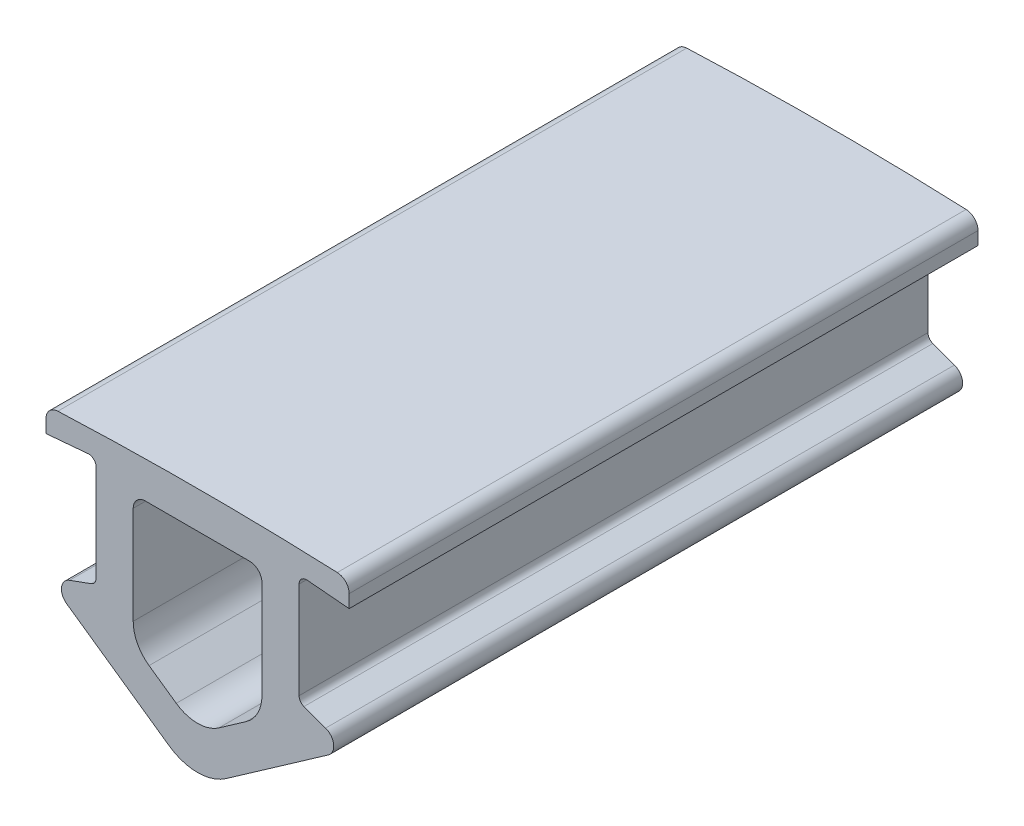
ISO-10303-21;
HEADER;
FILE_DESCRIPTION(('STEP AP214'),'2;1');
FILE_NAME('part.step','',(''),(''),'','','');
FILE_SCHEMA(('AUTOMOTIVE_DESIGN { 1 0 10303 214 1 1 1 1 }'));
ENDSEC;
DATA;
#1=APPLICATION_CONTEXT('core data for automotive mechanical design processes');
#2=APPLICATION_PROTOCOL_DEFINITION('international standard','automotive_design',2000,#1);
#3=PRODUCT_CONTEXT('',#1,'mechanical');
#4=PRODUCT('Part','Part','',(#3));
#5=PRODUCT_RELATED_PRODUCT_CATEGORY('part','',(#4));
#6=PRODUCT_DEFINITION_FORMATION('','',#4);
#7=PRODUCT_DEFINITION_CONTEXT('part definition',#1,'design');
#8=PRODUCT_DEFINITION('design','',#6,#7);
#9=PRODUCT_DEFINITION_SHAPE('','',#8);
#10=(LENGTH_UNIT() NAMED_UNIT(*) SI_UNIT(.MILLI.,.METRE.));
#11=(NAMED_UNIT(*) PLANE_ANGLE_UNIT() SI_UNIT($,.RADIAN.));
#12=(NAMED_UNIT(*) SI_UNIT($,.STERADIAN.) SOLID_ANGLE_UNIT());
#13=UNCERTAINTY_MEASURE_WITH_UNIT(LENGTH_MEASURE(1.E-05),#10,'distance_accuracy_value','');
#14=(GEOMETRIC_REPRESENTATION_CONTEXT(3) GLOBAL_UNCERTAINTY_ASSIGNED_CONTEXT((#13)) GLOBAL_UNIT_ASSIGNED_CONTEXT((#10,
#11,#12)) REPRESENTATION_CONTEXT('',''));
#15=CARTESIAN_POINT('',(0.,0.,0.));
#16=DIRECTION('',(0.,0.,1.));
#17=DIRECTION('',(1.,0.,0.));
#18=AXIS2_PLACEMENT_3D('',#15,#16,#17);
#19=CARTESIAN_POINT('',(4.9997820467107E-09,-133.869838655308,25.4));
#20=DIRECTION('',(0.,0.,-1.));
#21=DIRECTION('',(-1.,0.,0.));
#22=AXIS2_PLACEMENT_3D('',#19,#20,#21);
#23=CYLINDRICAL_SURFACE('',#22,135.012547725308);
#24=CARTESIAN_POINT('',(4.9997820467107E-09,-133.869838655308,0.));
#25=DIRECTION('',(0.,0.,1.));
#26=DIRECTION('',(1.,0.,0.));
#27=AXIS2_PLACEMENT_3D('',#24,#25,#26);
#28=CIRCLE('',#27,135.012547725308);
#29=CARTESIAN_POINT('',(5.64334073055143,1.02471552955858,0.));
#30=VERTEX_POINT('',#29);
#31=CARTESIAN_POINT('',(-5.64334072055146,1.0247155295586,0.));
#32=VERTEX_POINT('',#31);
#33=EDGE_CURVE('E296',#30,#32,#28,.T.);
#34=ORIENTED_EDGE('',*,*,#33,.T.);
#35=DIRECTION('',(0.,0.,-1.));
#36=VECTOR('',#35,1.);
#37=CARTESIAN_POINT('',(-5.64334072055146,1.0247155295586,25.4));
#38=LINE('',#37,#36);
#39=CARTESIAN_POINT('',(-5.64334072055146,1.0247155295586,25.4));
#40=VERTEX_POINT('',#39);
#41=EDGE_CURVE('E11',#40,#32,#38,.T.);
#42=ORIENTED_EDGE('',*,*,#41,.F.);
#43=CARTESIAN_POINT('',(4.9997820467107E-09,-133.869838655308,25.4));
#44=DIRECTION('',(0.,0.,1.));
#45=DIRECTION('',(1.,0.,0.));
#46=AXIS2_PLACEMENT_3D('',#43,#44,#45);
#47=CIRCLE('',#46,135.012547725308);
#48=CARTESIAN_POINT('',(5.64334073055143,1.02471552955858,25.4));
#49=VERTEX_POINT('',#48);
#50=EDGE_CURVE('E468',#49,#40,#47,.T.);
#51=ORIENTED_EDGE('',*,*,#50,.F.);
#52=DIRECTION('',(0.,0.,-1.));
#53=VECTOR('',#52,1.);
#54=CARTESIAN_POINT('',(5.64334073055143,1.02471552955858,25.4));
#55=LINE('',#54,#53);
#56=EDGE_CURVE('E343',#49,#30,#55,.T.);
#57=ORIENTED_EDGE('',*,*,#56,.T.);
#58=EDGE_LOOP('',(#34,#42,#51,#57));
#59=FACE_BOUND('',#58,.T.);
#60=ADVANCED_FACE('F35',(#59),#23,.T.);
#61=CARTESIAN_POINT('',(-5.62244140160035,0.525152513646621,25.4));
#62=DIRECTION('',(0.,0.,-1.));
#63=DIRECTION('',(-1.,0.,0.));
#64=AXIS2_PLACEMENT_3D('',#61,#62,#63);
#65=CYLINDRICAL_SURFACE('',#64,0.499999988399661);
#66=CARTESIAN_POINT('',(-5.62244140160035,0.525152513646621,0.));
#67=DIRECTION('',(0.,0.,1.));
#68=DIRECTION('',(1.,0.,0.));
#69=AXIS2_PLACEMENT_3D('',#66,#67,#68);
#70=CIRCLE('',#69,0.499999988399661);
#71=CARTESIAN_POINT('',(-6.12244139000001,0.525152513646621,0.));
#72=VERTEX_POINT('',#71);
#73=EDGE_CURVE('E299',#32,#72,#70,.T.);
#74=ORIENTED_EDGE('',*,*,#73,.T.);
#75=DIRECTION('',(0.,0.,-1.));
#76=VECTOR('',#75,1.);
#77=CARTESIAN_POINT('',(-6.12244139000001,0.525152513646621,25.4));
#78=LINE('',#77,#76);
#79=CARTESIAN_POINT('',(-6.12244139000001,0.525152513646621,25.4));
#80=VERTEX_POINT('',#79);
#81=EDGE_CURVE('E45',#80,#72,#78,.T.);
#82=ORIENTED_EDGE('',*,*,#81,.F.);
#83=CARTESIAN_POINT('',(-5.62244140160035,0.525152513646621,25.4));
#84=DIRECTION('',(0.,0.,1.));
#85=DIRECTION('',(1.,0.,0.));
#86=AXIS2_PLACEMENT_3D('',#83,#84,#85);
#87=CIRCLE('',#86,0.499999988399661);
#88=EDGE_CURVE('E470',#40,#80,#87,.T.);
#89=ORIENTED_EDGE('',*,*,#88,.F.);
#90=ORIENTED_EDGE('',*,*,#41,.T.);
#91=EDGE_LOOP('',(#74,#82,#89,#90));
#92=FACE_BOUND('',#91,.T.);
#93=ADVANCED_FACE('F524',(#92),#65,.T.);
#94=CARTESIAN_POINT('',(-6.12244139,0.,25.4));
#95=DIRECTION('',(1.,0.,0.));
#96=DIRECTION('',(0.,1.,0.));
#97=AXIS2_PLACEMENT_3D('',#94,#95,#96);
#98=PLANE('',#97);
#99=DIRECTION('',(0.,-1.,0.));
#100=VECTOR('',#99,1.);
#101=CARTESIAN_POINT('',(-6.12244139,0.,0.));
#102=LINE('',#101,#100);
#103=CARTESIAN_POINT('',(-6.12244139,0.,0.));
#104=VERTEX_POINT('',#103);
#105=EDGE_CURVE('E301',#72,#104,#102,.T.);
#106=ORIENTED_EDGE('',*,*,#105,.T.);
#107=DIRECTION('',(0.,0.,-1.));
#108=VECTOR('',#107,1.);
#109=CARTESIAN_POINT('',(-6.12244139,0.,25.4));
#110=LINE('',#109,#108);
#111=CARTESIAN_POINT('',(-6.12244139,0.,25.4));
#112=VERTEX_POINT('',#111);
#113=EDGE_CURVE('E379',#112,#104,#110,.T.);
#114=ORIENTED_EDGE('',*,*,#113,.F.);
#115=DIRECTION('',(0.,-1.,0.));
#116=VECTOR('',#115,1.);
#117=CARTESIAN_POINT('',(-6.12244139,0.,25.4));
#118=LINE('',#117,#116);
#119=EDGE_CURVE('E472',#80,#112,#118,.T.);
#120=ORIENTED_EDGE('',*,*,#119,.F.);
#121=ORIENTED_EDGE('',*,*,#81,.T.);
#122=EDGE_LOOP('',(#106,#114,#120,#121));
#123=FACE_BOUND('',#122,.T.);
#124=ADVANCED_FACE('F529',(#123),#98,.F.);
#125=CARTESIAN_POINT('',(-0.0465068209177292,0.531575395322367,25.4));
#126=DIRECTION('',(-0.0871557427805965,0.996194698088864,0.));
#127=DIRECTION('',(-0.996194698088864,-0.0871557427805965,0.));
#128=AXIS2_PLACEMENT_3D('',#125,#126,#127);
#129=PLANE('',#128);
#130=DIRECTION('',(0.996194698088864,0.0871557427805965,0.));
#131=VECTOR('',#130,1.);
#132=CARTESIAN_POINT('',(-0.0465068209177292,0.531575395322367,0.));
#133=LINE('',#132,#131);
#134=CARTESIAN_POINT('',(-4.42615282861294,0.148406019246547,0.));
#135=VERTEX_POINT('',#134);
#136=EDGE_CURVE('E303',#104,#135,#133,.T.);
#137=ORIENTED_EDGE('',*,*,#136,.T.);
#138=DIRECTION('',(0.,0.,-1.));
#139=VECTOR('',#138,1.);
#140=CARTESIAN_POINT('',(-4.42615282861294,0.148406019246547,25.4));
#141=LINE('',#140,#139);
#142=CARTESIAN_POINT('',(-4.42615282861294,0.148406019246547,25.4));
#143=VERTEX_POINT('',#142);
#144=EDGE_CURVE('E377',#143,#135,#141,.T.);
#145=ORIENTED_EDGE('',*,*,#144,.F.);
#146=DIRECTION('',(0.996194698088864,0.0871557427805965,0.));
#147=VECTOR('',#146,1.);
#148=CARTESIAN_POINT('',(-0.0465068209177292,0.531575395322367,25.4));
#149=LINE('',#148,#147);
#150=EDGE_CURVE('E474',#112,#143,#149,.T.);
#151=ORIENTED_EDGE('',*,*,#150,.F.);
#152=ORIENTED_EDGE('',*,*,#113,.T.);
#153=EDGE_LOOP('',(#137,#145,#151,#152));
#154=FACE_BOUND('',#153,.T.);
#155=ADVANCED_FACE('F608',(#154),#129,.F.);
#156=CARTESIAN_POINT('',(-4.40000610531548,-0.150452395475362,25.4));
#157=DIRECTION('',(0.,0.,-1.));
#158=DIRECTION('',(-1.,0.,0.));
#159=AXIS2_PLACEMENT_3D('',#156,#157,#158);
#160=CYLINDRICAL_SURFACE('',#159,0.300000005315477);
#161=CARTESIAN_POINT('',(-4.40000610531548,-0.150452395475362,0.));
#162=DIRECTION('',(0.,0.,1.));
#163=DIRECTION('',(1.,0.,0.));
#164=AXIS2_PLACEMENT_3D('',#161,#162,#163);
#165=CIRCLE('',#164,0.300000005315477);
#166=CARTESIAN_POINT('',(-4.1000061,-0.150452395475362,0.));
#167=VERTEX_POINT('',#166);
#168=EDGE_CURVE('E306',#167,#135,#165,.T.);
#169=ORIENTED_EDGE('',*,*,#168,.F.);
#170=DIRECTION('',(0.,0.,-1.));
#171=VECTOR('',#170,1.);
#172=CARTESIAN_POINT('',(-4.1000061,-0.150452395475362,25.4));
#173=LINE('',#172,#171);
#174=CARTESIAN_POINT('',(-4.1000061,-0.150452395475362,25.4));
#175=VERTEX_POINT('',#174);
#176=EDGE_CURVE('E375',#175,#167,#173,.T.);
#177=ORIENTED_EDGE('',*,*,#176,.F.);
#178=CARTESIAN_POINT('',(-4.40000610531548,-0.150452395475362,25.4));
#179=DIRECTION('',(0.,0.,1.));
#180=DIRECTION('',(1.,0.,0.));
#181=AXIS2_PLACEMENT_3D('',#178,#179,#180);
#182=CIRCLE('',#181,0.300000005315477);
#183=EDGE_CURVE('E476',#175,#143,#182,.T.);
#184=ORIENTED_EDGE('',*,*,#183,.T.);
#185=ORIENTED_EDGE('',*,*,#144,.T.);
#186=EDGE_LOOP('',(#169,#177,#184,#185));
#187=FACE_BOUND('',#186,.T.);
#188=ADVANCED_FACE('F604',(#187),#160,.F.);
#189=CARTESIAN_POINT('',(-4.1000061,0.,25.4));
#190=DIRECTION('',(1.,0.,0.));
#191=DIRECTION('',(0.,1.,0.));
#192=AXIS2_PLACEMENT_3D('',#189,#190,#191);
#193=PLANE('',#192);
#194=DIRECTION('',(0.,-1.,0.));
#195=VECTOR('',#194,1.);
#196=CARTESIAN_POINT('',(-4.1000061,0.,0.));
#197=LINE('',#196,#195);
#198=CARTESIAN_POINT('',(-4.1000061,-4.05582125151107,0.));
#199=VERTEX_POINT('',#198);
#200=EDGE_CURVE('E309',#167,#199,#197,.T.);
#201=ORIENTED_EDGE('',*,*,#200,.T.);
#202=DIRECTION('',(0.,0.,-1.));
#203=VECTOR('',#202,1.);
#204=CARTESIAN_POINT('',(-4.1000061,-4.05582125151107,25.4));
#205=LINE('',#204,#203);
#206=CARTESIAN_POINT('',(-4.1000061,-4.05582125151107,25.4));
#207=VERTEX_POINT('',#206);
#208=EDGE_CURVE('E373',#207,#199,#205,.T.);
#209=ORIENTED_EDGE('',*,*,#208,.F.);
#210=DIRECTION('',(0.,-1.,0.));
#211=VECTOR('',#210,1.);
#212=CARTESIAN_POINT('',(-4.1000061,0.,25.4));
#213=LINE('',#212,#211);
#214=EDGE_CURVE('E479',#175,#207,#213,.T.);
#215=ORIENTED_EDGE('',*,*,#214,.F.);
#216=ORIENTED_EDGE('',*,*,#176,.T.);
#217=EDGE_LOOP('',(#201,#209,#215,#216));
#218=FACE_BOUND('',#217,.T.);
#219=ADVANCED_FACE('F600',(#218),#193,.F.);
#220=CARTESIAN_POINT('',(-4.40000609869862,-4.05582125151107,25.4));
#221=DIRECTION('',(0.,0.,-1.));
#222=DIRECTION('',(-1.,0.,0.));
#223=AXIS2_PLACEMENT_3D('',#220,#221,#222);
#224=CYLINDRICAL_SURFACE('',#223,0.300000003697387);
#225=CARTESIAN_POINT('',(-4.40000609869862,-4.05582125151107,0.));
#226=DIRECTION('',(0.,0.,1.));
#227=DIRECTION('',(1.,0.,0.));
#228=AXIS2_PLACEMENT_3D('',#225,#226,#227);
#229=CIRCLE('',#228,0.300000003697387);
#230=CARTESIAN_POINT('',(-4.29740005128005,-4.33772904539204,0.));
#231=VERTEX_POINT('',#230);
#232=EDGE_CURVE('E312',#231,#199,#229,.T.);
#233=ORIENTED_EDGE('',*,*,#232,.F.);
#234=DIRECTION('',(0.,0.,-1.));
#235=VECTOR('',#234,1.);
#236=CARTESIAN_POINT('',(-4.29740005128005,-4.33772904539204,25.4));
#237=LINE('',#236,#235);
#238=CARTESIAN_POINT('',(-4.29740005128005,-4.33772904539204,25.4));
#239=VERTEX_POINT('',#238);
#240=EDGE_CURVE('E371',#239,#231,#237,.T.);
#241=ORIENTED_EDGE('',*,*,#240,.F.);
#242=CARTESIAN_POINT('',(-4.40000609869862,-4.05582125151107,25.4));
#243=DIRECTION('',(0.,0.,1.));
#244=DIRECTION('',(1.,0.,0.));
#245=AXIS2_PLACEMENT_3D('',#242,#243,#244);
#246=CIRCLE('',#245,0.300000003697387);
#247=EDGE_CURVE('E481',#239,#207,#246,.T.);
#248=ORIENTED_EDGE('',*,*,#247,.T.);
#249=ORIENTED_EDGE('',*,*,#208,.T.);
#250=EDGE_LOOP('',(#233,#241,#248,#249));
#251=FACE_BOUND('',#250,.T.);
#252=ADVANCED_FACE('F596',(#251),#224,.F.);
#253=CARTESIAN_POINT('',(0.891418934085434,-2.44915335356994,25.4));
#254=DIRECTION('',(0.342020148147696,-0.939692619030834,0.));
#255=DIRECTION('',(0.939692619030834,0.342020148147696,0.));
#256=AXIS2_PLACEMENT_3D('',#253,#254,#255);
#257=PLANE('',#256);
#258=DIRECTION('',(-0.939692619030834,-0.342020148147696,0.));
#259=VECTOR('',#258,1.);
#260=CARTESIAN_POINT('',(0.891418934085434,-2.44915335356994,0.));
#261=LINE('',#260,#259);
#262=CARTESIAN_POINT('',(-5.17101006481665,-4.65569709175305,0.));
#263=VERTEX_POINT('',#262);
#264=EDGE_CURVE('E315',#231,#263,#261,.T.);
#265=ORIENTED_EDGE('',*,*,#264,.T.);
#266=DIRECTION('',(0.,0.,-1.));
#267=VECTOR('',#266,1.);
#268=CARTESIAN_POINT('',(-5.17101006481665,-4.65569709175305,25.4));
#269=LINE('',#268,#267);
#270=CARTESIAN_POINT('',(-5.17101006481665,-4.65569709175305,25.4));
#271=VERTEX_POINT('',#270);
#272=EDGE_CURVE('E368',#271,#263,#269,.T.);
#273=ORIENTED_EDGE('',*,*,#272,.F.);
#274=DIRECTION('',(-0.939692619030834,-0.342020148147696,0.));
#275=VECTOR('',#274,1.);
#276=CARTESIAN_POINT('',(0.891418934085434,-2.44915335356994,25.4));
#277=LINE('',#276,#275);
#278=EDGE_CURVE('E484',#239,#271,#277,.T.);
#279=ORIENTED_EDGE('',*,*,#278,.F.);
#280=ORIENTED_EDGE('',*,*,#240,.T.);
#281=EDGE_LOOP('',(#265,#273,#279,#280));
#282=FACE_BOUND('',#281,.T.);
#283=ADVANCED_FACE('F592',(#282),#257,.F.);
#284=CARTESIAN_POINT('',(-4.9999999912156,-5.12554339996945,25.4));
#285=DIRECTION('',(0.,0.,-1.));
#286=DIRECTION('',(-1.,0.,0.));
#287=AXIS2_PLACEMENT_3D('',#284,#285,#286);
#288=CYLINDRICAL_SURFACE('',#287,0.499999998617614);
#289=CARTESIAN_POINT('',(-4.9999999912156,-5.12554339996945,0.));
#290=DIRECTION('',(0.,0.,1.));
#291=DIRECTION('',(1.,0.,0.));
#292=AXIS2_PLACEMENT_3D('',#289,#290,#291);
#293=CIRCLE('',#292,0.499999998617614);
#294=CARTESIAN_POINT('',(-5.28678820743577,-5.53511942179552,0.));
#295=VERTEX_POINT('',#294);
#296=EDGE_CURVE('E317',#263,#295,#293,.T.);
#297=ORIENTED_EDGE('',*,*,#296,.T.);
#298=DIRECTION('',(0.,0.,-1.));
#299=VECTOR('',#298,1.);
#300=CARTESIAN_POINT('',(-5.28678820743577,-5.53511942179552,25.4));
#301=LINE('',#300,#299);
#302=CARTESIAN_POINT('',(-5.28678820743577,-5.53511942179552,25.4));
#303=VERTEX_POINT('',#302);
#304=EDGE_CURVE('E365',#303,#295,#301,.T.);
#305=ORIENTED_EDGE('',*,*,#304,.F.);
#306=CARTESIAN_POINT('',(-4.9999999912156,-5.12554339996945,25.4));
#307=DIRECTION('',(0.,0.,1.));
#308=DIRECTION('',(1.,0.,0.));
#309=AXIS2_PLACEMENT_3D('',#306,#307,#308);
#310=CIRCLE('',#309,0.499999998617614);
#311=EDGE_CURVE('E486',#271,#303,#310,.T.);
#312=ORIENTED_EDGE('',*,*,#311,.F.);
#313=ORIENTED_EDGE('',*,*,#272,.T.);
#314=EDGE_LOOP('',(#297,#305,#312,#313));
#315=FACE_BOUND('',#314,.T.);
#316=ADVANCED_FACE('F588',(#315),#288,.T.);
#317=CARTESIAN_POINT('',(-4.33995549194015,-6.1980988226043,25.4));
#318=DIRECTION('',(0.573576434026151,0.819152045916901,0.));
#319=DIRECTION('',(-0.819152045916901,0.573576434026151,0.));
#320=AXIS2_PLACEMENT_3D('',#317,#318,#319);
#321=PLANE('',#320);
#322=DIRECTION('',(0.819152045916901,-0.573576434026151,0.));
#323=VECTOR('',#322,1.);
#324=CARTESIAN_POINT('',(-4.33995549194015,-6.1980988226043,0.));
#325=LINE('',#324,#323);
#326=CARTESIAN_POINT('',(-1.14715285683124,-8.43372328221878,0.));
#327=VERTEX_POINT('',#326);
#328=EDGE_CURVE('E319',#295,#327,#325,.T.);
#329=ORIENTED_EDGE('',*,*,#328,.T.);
#330=DIRECTION('',(0.,0.,-1.));
#331=VECTOR('',#330,1.);
#332=CARTESIAN_POINT('',(-1.14715285683124,-8.43372328221878,25.4));
#333=LINE('',#332,#331);
#334=CARTESIAN_POINT('',(-1.14715285683124,-8.43372328221878,25.4));
#335=VERTEX_POINT('',#334);
#336=EDGE_CURVE('E362',#335,#327,#333,.T.);
#337=ORIENTED_EDGE('',*,*,#336,.F.);
#338=DIRECTION('',(0.819152045916901,-0.573576434026151,0.));
#339=VECTOR('',#338,1.);
#340=CARTESIAN_POINT('',(-4.33995549194015,-6.1980988226043,25.4));
#341=LINE('',#340,#339);
#342=EDGE_CURVE('E488',#303,#335,#341,.T.);
#343=ORIENTED_EDGE('',*,*,#342,.F.);
#344=ORIENTED_EDGE('',*,*,#304,.T.);
#345=EDGE_LOOP('',(#329,#337,#343,#344));
#346=FACE_BOUND('',#345,.T.);
#347=ADVANCED_FACE('F584',(#346),#321,.F.);
#348=CARTESIAN_POINT('',(9.99996335737663E-09,-6.79541919212888,25.4));
#349=DIRECTION('',(0.,0.,-1.));
#350=DIRECTION('',(-1.,0.,0.));
#351=AXIS2_PLACEMENT_3D('',#348,#349,#350);
#352=CYLINDRICAL_SURFACE('',#351,1.99999999787108);
#353=CARTESIAN_POINT('',(9.99996335737663E-09,-6.79541919212888,0.));
#354=DIRECTION('',(0.,0.,1.));
#355=DIRECTION('',(1.,0.,0.));
#356=AXIS2_PLACEMENT_3D('',#353,#354,#355);
#357=CIRCLE('',#356,1.99999999787108);
#358=CARTESIAN_POINT('',(1.14715287683119,-8.43372328221877,0.));
#359=VERTEX_POINT('',#358);
#360=EDGE_CURVE('E321',#327,#359,#357,.T.);
#361=ORIENTED_EDGE('',*,*,#360,.T.);
#362=DIRECTION('',(0.,0.,-1.));
#363=VECTOR('',#362,1.);
#364=CARTESIAN_POINT('',(1.14715287683119,-8.43372328221877,25.4));
#365=LINE('',#364,#363);
#366=CARTESIAN_POINT('',(1.14715287683119,-8.43372328221877,25.4));
#367=VERTEX_POINT('',#366);
#368=EDGE_CURVE('E359',#367,#359,#365,.T.);
#369=ORIENTED_EDGE('',*,*,#368,.F.);
#370=CARTESIAN_POINT('',(9.99996335737663E-09,-6.79541919212888,25.4));
#371=DIRECTION('',(0.,0.,1.));
#372=DIRECTION('',(1.,0.,0.));
#373=AXIS2_PLACEMENT_3D('',#370,#371,#372);
#374=CIRCLE('',#373,1.99999999787108);
#375=EDGE_CURVE('E490',#335,#367,#374,.T.);
#376=ORIENTED_EDGE('',*,*,#375,.F.);
#377=ORIENTED_EDGE('',*,*,#336,.T.);
#378=EDGE_LOOP('',(#361,#369,#376,#377));
#379=FACE_BOUND('',#378,.T.);
#380=ADVANCED_FACE('F580',(#379),#352,.T.);
#381=CARTESIAN_POINT('',(4.33995549851997,-6.1980988320011,25.4));
#382=DIRECTION('',(-0.573576434026161,0.819152045916894,0.));
#383=DIRECTION('',(-0.819152045916894,-0.573576434026161,0.));
#384=AXIS2_PLACEMENT_3D('',#381,#382,#383);
#385=PLANE('',#384);
#386=DIRECTION('',(0.819152045916894,0.573576434026161,0.));
#387=VECTOR('',#386,1.);
#388=CARTESIAN_POINT('',(4.33995549851997,-6.1980988320011,0.));
#389=LINE('',#388,#387);
#390=CARTESIAN_POINT('',(5.28678822743564,-5.53511942179548,0.));
#391=VERTEX_POINT('',#390);
#392=EDGE_CURVE('E323',#359,#391,#389,.T.);
#393=ORIENTED_EDGE('',*,*,#392,.T.);
#394=DIRECTION('',(0.,0.,-1.));
#395=VECTOR('',#394,1.);
#396=CARTESIAN_POINT('',(5.28678822743564,-5.53511942179548,25.4));
#397=LINE('',#396,#395);
#398=CARTESIAN_POINT('',(5.28678822743564,-5.53511942179548,25.4));
#399=VERTEX_POINT('',#398);
#400=EDGE_CURVE('E356',#399,#391,#397,.T.);
#401=ORIENTED_EDGE('',*,*,#400,.F.);
#402=DIRECTION('',(0.819152045916894,0.573576434026161,0.));
#403=VECTOR('',#402,1.);
#404=CARTESIAN_POINT('',(4.33995549851997,-6.1980988320011,25.4));
#405=LINE('',#404,#403);
#406=EDGE_CURVE('E492',#367,#399,#405,.T.);
#407=ORIENTED_EDGE('',*,*,#406,.F.);
#408=ORIENTED_EDGE('',*,*,#368,.T.);
#409=EDGE_LOOP('',(#393,#401,#407,#408));
#410=FACE_BOUND('',#409,.T.);
#411=ADVANCED_FACE('F576',(#410),#385,.F.);
#412=CARTESIAN_POINT('',(5.0000000112155,-5.12554339996947,25.4));
#413=DIRECTION('',(0.,0.,-1.));
#414=DIRECTION('',(-1.,0.,0.));
#415=AXIS2_PLACEMENT_3D('',#412,#413,#414);
#416=CYLINDRICAL_SURFACE('',#415,0.499999998617586);
#417=CARTESIAN_POINT('',(5.0000000112155,-5.12554339996947,0.));
#418=DIRECTION('',(0.,0.,1.));
#419=DIRECTION('',(1.,0.,0.));
#420=AXIS2_PLACEMENT_3D('',#417,#418,#419);
#421=CIRCLE('',#420,0.499999998617586);
#422=CARTESIAN_POINT('',(5.17101008481657,-4.65569709175308,0.));
#423=VERTEX_POINT('',#422);
#424=EDGE_CURVE('E325',#391,#423,#421,.T.);
#425=ORIENTED_EDGE('',*,*,#424,.T.);
#426=DIRECTION('',(0.,0.,-1.));
#427=VECTOR('',#426,1.);
#428=CARTESIAN_POINT('',(5.17101008481657,-4.65569709175308,25.4));
#429=LINE('',#428,#427);
#430=CARTESIAN_POINT('',(5.17101008481657,-4.65569709175308,25.4));
#431=VERTEX_POINT('',#430);
#432=EDGE_CURVE('E353',#431,#423,#429,.T.);
#433=ORIENTED_EDGE('',*,*,#432,.F.);
#434=CARTESIAN_POINT('',(5.0000000112155,-5.12554339996947,25.4));
#435=DIRECTION('',(0.,0.,1.));
#436=DIRECTION('',(1.,0.,0.));
#437=AXIS2_PLACEMENT_3D('',#434,#435,#436);
#438=CIRCLE('',#437,0.499999998617586);
#439=EDGE_CURVE('E494',#399,#431,#438,.T.);
#440=ORIENTED_EDGE('',*,*,#439,.F.);
#441=ORIENTED_EDGE('',*,*,#400,.T.);
#442=EDGE_LOOP('',(#425,#433,#440,#441));
#443=FACE_BOUND('',#442,.T.);
#444=ADVANCED_FACE('F572',(#443),#416,.T.);
#445=CARTESIAN_POINT('',(-0.891418931745912,-2.44915334714166,25.4));
#446=DIRECTION('',(-0.342020148147756,-0.939692619030812,0.));
#447=DIRECTION('',(0.939692619030812,-0.342020148147756,0.));
#448=AXIS2_PLACEMENT_3D('',#445,#446,#447);
#449=PLANE('',#448);
#450=DIRECTION('',(-0.939692619030812,0.342020148147756,0.));
#451=VECTOR('',#450,1.);
#452=CARTESIAN_POINT('',(-0.891418931745912,-2.44915334714166,0.));
#453=LINE('',#452,#451);
#454=CARTESIAN_POINT('',(4.29740007128005,-4.33772904539203,0.));
#455=VERTEX_POINT('',#454);
#456=EDGE_CURVE('E327',#423,#455,#453,.T.);
#457=ORIENTED_EDGE('',*,*,#456,.T.);
#458=DIRECTION('',(0.,0.,-1.));
#459=VECTOR('',#458,1.);
#460=CARTESIAN_POINT('',(4.29740007128005,-4.33772904539203,25.4));
#461=LINE('',#460,#459);
#462=CARTESIAN_POINT('',(4.29740007128005,-4.33772904539203,25.4));
#463=VERTEX_POINT('',#462);
#464=EDGE_CURVE('E351',#463,#455,#461,.T.);
#465=ORIENTED_EDGE('',*,*,#464,.F.);
#466=DIRECTION('',(-0.939692619030812,0.342020148147756,0.));
#467=VECTOR('',#466,1.);
#468=CARTESIAN_POINT('',(-0.891418931745912,-2.44915334714166,25.4));
#469=LINE('',#468,#467);
#470=EDGE_CURVE('E496',#431,#463,#469,.T.);
#471=ORIENTED_EDGE('',*,*,#470,.F.);
#472=ORIENTED_EDGE('',*,*,#432,.T.);
#473=EDGE_LOOP('',(#457,#465,#471,#472));
#474=FACE_BOUND('',#473,.T.);
#475=ADVANCED_FACE('F568',(#474),#449,.F.);
#476=CARTESIAN_POINT('',(4.40000611869864,-4.05582125151107,25.4));
#477=DIRECTION('',(0.,0.,-1.));
#478=DIRECTION('',(-1.,0.,0.));
#479=AXIS2_PLACEMENT_3D('',#476,#477,#478);
#480=CYLINDRICAL_SURFACE('',#479,0.300000008697388);
#481=CARTESIAN_POINT('',(4.40000611869864,-4.05582125151107,0.));
#482=DIRECTION('',(0.,0.,1.));
#483=DIRECTION('',(1.,0.,0.));
#484=AXIS2_PLACEMENT_3D('',#481,#482,#483);
#485=CIRCLE('',#484,0.300000008697388);
#486=CARTESIAN_POINT('',(4.10000611000002,-4.05582125151107,0.));
#487=VERTEX_POINT('',#486);
#488=EDGE_CURVE('E330',#487,#455,#485,.T.);
#489=ORIENTED_EDGE('',*,*,#488,.F.);
#490=DIRECTION('',(0.,0.,-1.));
#491=VECTOR('',#490,1.);
#492=CARTESIAN_POINT('',(4.10000611000002,-4.05582125151107,25.4));
#493=LINE('',#492,#491);
#494=CARTESIAN_POINT('',(4.10000611000002,-4.05582125151107,25.4));
#495=VERTEX_POINT('',#494);
#496=EDGE_CURVE('E349',#495,#487,#493,.T.);
#497=ORIENTED_EDGE('',*,*,#496,.F.);
#498=CARTESIAN_POINT('',(4.40000611869864,-4.05582125151107,25.4));
#499=DIRECTION('',(0.,0.,1.));
#500=DIRECTION('',(1.,0.,0.));
#501=AXIS2_PLACEMENT_3D('',#498,#499,#500);
#502=CIRCLE('',#501,0.300000008697388);
#503=EDGE_CURVE('E498',#495,#463,#502,.T.);
#504=ORIENTED_EDGE('',*,*,#503,.T.);
#505=ORIENTED_EDGE('',*,*,#464,.T.);
#506=EDGE_LOOP('',(#489,#497,#504,#505));
#507=FACE_BOUND('',#506,.T.);
#508=ADVANCED_FACE('F564',(#507),#480,.F.);
#509=CARTESIAN_POINT('',(4.10000611000002,0.,25.4));
#510=DIRECTION('',(-1.,0.,0.));
#511=DIRECTION('',(0.,0.,1.));
#512=AXIS2_PLACEMENT_3D('',#509,#510,#511);
#513=PLANE('',#512);
#514=DIRECTION('',(0.,1.,0.));
#515=VECTOR('',#514,1.);
#516=CARTESIAN_POINT('',(4.10000611000002,0.,0.));
#517=LINE('',#516,#515);
#518=CARTESIAN_POINT('',(4.10000611000002,-0.150452380121493,0.));
#519=VERTEX_POINT('',#518);
#520=EDGE_CURVE('E333',#487,#519,#517,.T.);
#521=ORIENTED_EDGE('',*,*,#520,.T.);
#522=DIRECTION('',(0.,0.,-1.));
#523=VECTOR('',#522,1.);
#524=CARTESIAN_POINT('',(4.10000611000002,-0.150452380121493,25.4));
#525=LINE('',#524,#523);
#526=CARTESIAN_POINT('',(4.10000611000002,-0.150452380121493,25.4));
#527=VERTEX_POINT('',#526);
#528=EDGE_CURVE('E347',#527,#519,#525,.T.);
#529=ORIENTED_EDGE('',*,*,#528,.F.);
#530=DIRECTION('',(0.,1.,0.));
#531=VECTOR('',#530,1.);
#532=CARTESIAN_POINT('',(4.10000611000002,0.,25.4));
#533=LINE('',#532,#531);
#534=EDGE_CURVE('E501',#495,#527,#533,.T.);
#535=ORIENTED_EDGE('',*,*,#534,.F.);
#536=ORIENTED_EDGE('',*,*,#496,.T.);
#537=EDGE_LOOP('',(#521,#529,#535,#536));
#538=FACE_BOUND('',#537,.T.);
#539=ADVANCED_FACE('F561',(#538),#513,.F.);
#540=CARTESIAN_POINT('',(4.40000610124618,-0.150452380121493,25.4));
#541=DIRECTION('',(0.,0.,-1.));
#542=DIRECTION('',(-1.,0.,0.));
#543=AXIS2_PLACEMENT_3D('',#540,#541,#542);
#544=CYLINDRICAL_SURFACE('',#543,0.299999991246166);
#545=CARTESIAN_POINT('',(4.40000610124618,-0.150452380121493,0.));
#546=DIRECTION('',(0.,0.,1.));
#547=DIRECTION('',(1.,0.,0.));
#548=AXIS2_PLACEMENT_3D('',#545,#546,#547);
#549=CIRCLE('',#548,0.299999991246166);
#550=CARTESIAN_POINT('',(4.4261528233174,0.148406020584649,0.));
#551=VERTEX_POINT('',#550);
#552=EDGE_CURVE('E336',#551,#519,#549,.T.);
#553=ORIENTED_EDGE('',*,*,#552,.F.);
#554=DIRECTION('',(0.,0.,-1.));
#555=VECTOR('',#554,1.);
#556=CARTESIAN_POINT('',(4.4261528233174,0.148406020584649,25.4));
#557=LINE('',#556,#555);
#558=CARTESIAN_POINT('',(4.4261528233174,0.148406020584649,25.4));
#559=VERTEX_POINT('',#558);
#560=EDGE_CURVE('E257',#559,#551,#557,.T.);
#561=ORIENTED_EDGE('',*,*,#560,.F.);
#562=CARTESIAN_POINT('',(4.40000610124618,-0.150452380121493,25.4));
#563=DIRECTION('',(0.,0.,1.));
#564=DIRECTION('',(1.,0.,0.));
#565=AXIS2_PLACEMENT_3D('',#562,#563,#564);
#566=CIRCLE('',#565,0.299999991246166);
#567=EDGE_CURVE('E250',#559,#527,#566,.T.);
#568=ORIENTED_EDGE('',*,*,#567,.T.);
#569=ORIENTED_EDGE('',*,*,#528,.T.);
#570=EDGE_LOOP('',(#553,#561,#568,#569));
#571=FACE_BOUND('',#570,.T.);
#572=ADVANCED_FACE('F504',(#571),#544,.F.);
#573=CARTESIAN_POINT('',(0.0465068209936477,0.531575396190357,25.4));
#574=DIRECTION('',(0.0871557427805579,0.996194698088867,0.));
#575=DIRECTION('',(-0.996194698088867,0.0871557427805579,0.));
#576=AXIS2_PLACEMENT_3D('',#573,#574,#575);
#577=PLANE('',#576);
#578=DIRECTION('',(0.996194698088867,-0.0871557427805579,0.));
#579=VECTOR('',#578,1.);
#580=CARTESIAN_POINT('',(0.0465068209936477,0.531575396190357,0.));
#581=LINE('',#580,#579);
#582=CARTESIAN_POINT('',(6.12244140000001,0.,0.));
#583=VERTEX_POINT('',#582);
#584=EDGE_CURVE('E256',#551,#583,#581,.T.);
#585=ORIENTED_EDGE('',*,*,#584,.T.);
#586=DIRECTION('',(0.,0.,-1.));
#587=VECTOR('',#586,1.);
#588=CARTESIAN_POINT('',(6.12244140000001,0.,25.4));
#589=LINE('',#588,#587);
#590=CARTESIAN_POINT('',(6.12244140000001,0.,25.4));
#591=VERTEX_POINT('',#590);
#592=EDGE_CURVE('E253',#591,#583,#589,.T.);
#593=ORIENTED_EDGE('',*,*,#592,.F.);
#594=DIRECTION('',(0.996194698088867,-0.0871557427805579,0.));
#595=VECTOR('',#594,1.);
#596=CARTESIAN_POINT('',(0.0465068209936477,0.531575396190357,25.4));
#597=LINE('',#596,#595);
#598=EDGE_CURVE('E244',#559,#591,#597,.T.);
#599=ORIENTED_EDGE('',*,*,#598,.F.);
#600=ORIENTED_EDGE('',*,*,#560,.T.);
#601=EDGE_LOOP('',(#585,#593,#599,#600));
#602=FACE_BOUND('',#601,.T.);
#603=ADVANCED_FACE('F254',(#602),#577,.F.);
#604=CARTESIAN_POINT('',(6.12244140000001,0.,25.4));
#605=DIRECTION('',(-1.,0.,0.));
#606=DIRECTION('',(0.,-1.,0.));
#607=AXIS2_PLACEMENT_3D('',#604,#605,#606);
#608=PLANE('',#607);
#609=DIRECTION('',(0.,1.,0.));
#610=VECTOR('',#609,1.);
#611=CARTESIAN_POINT('',(6.12244140000001,0.,0.));
#612=LINE('',#611,#610);
#613=CARTESIAN_POINT('',(6.12244140000001,0.525152513646603,0.));
#614=VERTEX_POINT('',#613);
#615=EDGE_CURVE('E149',#583,#614,#612,.T.);
#616=ORIENTED_EDGE('',*,*,#615,.T.);
#617=DIRECTION('',(0.,0.,-1.));
#618=VECTOR('',#617,1.);
#619=CARTESIAN_POINT('',(6.12244140000001,0.525152513646603,25.4));
#620=LINE('',#619,#618);
#621=CARTESIAN_POINT('',(6.12244140000001,0.525152513646603,25.4));
#622=VERTEX_POINT('',#621);
#623=EDGE_CURVE('E258',#622,#614,#620,.T.);
#624=ORIENTED_EDGE('',*,*,#623,.F.);
#625=DIRECTION('',(0.,1.,0.));
#626=VECTOR('',#625,1.);
#627=CARTESIAN_POINT('',(6.12244140000001,0.,25.4));
#628=LINE('',#627,#626);
#629=EDGE_CURVE('E248',#591,#622,#628,.T.);
#630=ORIENTED_EDGE('',*,*,#629,.F.);
#631=ORIENTED_EDGE('',*,*,#592,.T.);
#632=EDGE_LOOP('',(#616,#624,#630,#631));
#633=FACE_BOUND('',#632,.T.);
#634=ADVANCED_FACE('F260',(#633),#608,.F.);
#635=CARTESIAN_POINT('',(-2.1000061079744,-0.850452152025643,25.4));
#636=DIRECTION('',(0.,0.,-1.));
#637=DIRECTION('',(-1.,0.,0.));
#638=AXIS2_PLACEMENT_3D('',#635,#636,#637);
#639=CYLINDRICAL_SURFACE('',#638,0.500000002025568);
#640=CARTESIAN_POINT('',(-2.1000061079744,-0.850452152025643,0.));
#641=DIRECTION('',(0.,0.,1.));
#642=DIRECTION('',(1.,0.,0.));
#643=AXIS2_PLACEMENT_3D('',#640,#641,#642);
#644=CIRCLE('',#643,0.500000002025568);
#645=CARTESIAN_POINT('',(-2.1000061079744,-0.350452150000073,0.));
#646=VERTEX_POINT('',#645);
#647=CARTESIAN_POINT('',(-2.60000610999997,-0.850452152025643,0.));
#648=VERTEX_POINT('',#647);
#649=EDGE_CURVE('E266',#646,#648,#644,.T.);
#650=ORIENTED_EDGE('',*,*,#649,.F.);
#651=DIRECTION('',(0.,0.,-1.));
#652=VECTOR('',#651,1.);
#653=CARTESIAN_POINT('',(-2.1000061079744,-0.350452150000073,25.4));
#654=LINE('',#653,#652);
#655=CARTESIAN_POINT('',(-2.1000061079744,-0.350452150000073,25.4));
#656=VERTEX_POINT('',#655);
#657=EDGE_CURVE('E39',#656,#646,#654,.T.);
#658=ORIENTED_EDGE('',*,*,#657,.F.);
#659=CARTESIAN_POINT('',(-2.1000061079744,-0.850452152025643,25.4));
#660=DIRECTION('',(0.,0.,1.));
#661=DIRECTION('',(1.,0.,0.));
#662=AXIS2_PLACEMENT_3D('',#659,#660,#661);
#663=CIRCLE('',#662,0.500000002025568);
#664=CARTESIAN_POINT('',(-2.60000610999997,-0.850452152025643,25.4));
#665=VERTEX_POINT('',#664);
#666=EDGE_CURVE('E342',#656,#665,#663,.T.);
#667=ORIENTED_EDGE('',*,*,#666,.T.);
#668=DIRECTION('',(0.,0.,-1.));
#669=VECTOR('',#668,1.);
#670=CARTESIAN_POINT('',(-2.60000610999997,-0.850452152025643,25.4));
#671=LINE('',#670,#669);
#672=EDGE_CURVE('E262',#665,#648,#671,.T.);
#673=ORIENTED_EDGE('',*,*,#672,.T.);
#674=EDGE_LOOP('',(#650,#658,#667,#673));
#675=FACE_BOUND('',#674,.T.);
#676=ADVANCED_FACE('F37',(#675),#639,.F.);
#677=CARTESIAN_POINT('',(0.,-0.350452150000073,25.4));
#678=DIRECTION('',(0.,1.,0.));
#679=DIRECTION('',(0.,0.,1.));
#680=AXIS2_PLACEMENT_3D('',#677,#678,#679);
#681=PLANE('',#680);
#682=DIRECTION('',(1.,0.,0.));
#683=VECTOR('',#682,1.);
#684=CARTESIAN_POINT('',(0.,-0.350452150000073,0.));
#685=LINE('',#684,#683);
#686=CARTESIAN_POINT('',(2.10000609797445,-0.350452150000073,0.));
#687=VERTEX_POINT('',#686);
#688=EDGE_CURVE('E269',#646,#687,#685,.T.);
#689=ORIENTED_EDGE('',*,*,#688,.T.);
#690=DIRECTION('',(0.,0.,-1.));
#691=VECTOR('',#690,1.);
#692=CARTESIAN_POINT('',(2.10000609797445,-0.350452150000073,25.4));
#693=LINE('',#692,#691);
#694=CARTESIAN_POINT('',(2.10000609797445,-0.350452150000073,25.4));
#695=VERTEX_POINT('',#694);
#696=EDGE_CURVE('E398',#695,#687,#693,.T.);
#697=ORIENTED_EDGE('',*,*,#696,.F.);
#698=DIRECTION('',(1.,0.,0.));
#699=VECTOR('',#698,1.);
#700=CARTESIAN_POINT('',(0.,-0.350452150000073,25.4));
#701=LINE('',#700,#699);
#702=EDGE_CURVE('E406',#656,#695,#701,.T.);
#703=ORIENTED_EDGE('',*,*,#702,.F.);
#704=ORIENTED_EDGE('',*,*,#657,.T.);
#705=EDGE_LOOP('',(#689,#697,#703,#704));
#706=FACE_BOUND('',#705,.T.);
#707=ADVANCED_FACE('F405',(#706),#681,.F.);
#708=CARTESIAN_POINT('',(2.10000609797445,-0.850452152025572,25.4));
#709=DIRECTION('',(0.,0.,-1.));
#710=DIRECTION('',(-1.,0.,0.));
#711=AXIS2_PLACEMENT_3D('',#708,#709,#710);
#712=CYLINDRICAL_SURFACE('',#711,0.500000002025531);
#713=CARTESIAN_POINT('',(2.10000609797445,-0.850452152025572,0.));
#714=DIRECTION('',(0.,0.,1.));
#715=DIRECTION('',(1.,0.,0.));
#716=AXIS2_PLACEMENT_3D('',#713,#714,#715);
#717=CIRCLE('',#716,0.500000002025531);
#718=CARTESIAN_POINT('',(2.60000610000002,-0.850452152025572,0.));
#719=VERTEX_POINT('',#718);
#720=EDGE_CURVE('E272',#719,#687,#717,.T.);
#721=ORIENTED_EDGE('',*,*,#720,.F.);
#722=DIRECTION('',(0.,0.,-1.));
#723=VECTOR('',#722,1.);
#724=CARTESIAN_POINT('',(2.60000610000002,-0.850452152025572,25.4));
#725=LINE('',#724,#723);
#726=CARTESIAN_POINT('',(2.60000610000002,-0.850452152025572,25.4));
#727=VERTEX_POINT('',#726);
#728=EDGE_CURVE('E397',#727,#719,#725,.T.);
#729=ORIENTED_EDGE('',*,*,#728,.F.);
#730=CARTESIAN_POINT('',(2.10000609797445,-0.850452152025572,25.4));
#731=DIRECTION('',(0.,0.,1.));
#732=DIRECTION('',(1.,0.,0.));
#733=AXIS2_PLACEMENT_3D('',#730,#731,#732);
#734=CIRCLE('',#733,0.500000002025531);
#735=EDGE_CURVE('E451',#727,#695,#734,.T.);
#736=ORIENTED_EDGE('',*,*,#735,.T.);
#737=ORIENTED_EDGE('',*,*,#696,.T.);
#738=EDGE_LOOP('',(#721,#729,#736,#737));
#739=FACE_BOUND('',#738,.T.);
#740=ADVANCED_FACE('F449',(#739),#712,.F.);
#741=CARTESIAN_POINT('',(2.60000610000002,0.,25.4));
#742=DIRECTION('',(1.,0.,0.));
#743=DIRECTION('',(0.,0.,-1.));
#744=AXIS2_PLACEMENT_3D('',#741,#742,#743);
#745=PLANE('',#744);
#746=DIRECTION('',(0.,-1.,0.));
#747=VECTOR('',#746,1.);
#748=CARTESIAN_POINT('',(2.60000610000002,0.,0.));
#749=LINE('',#748,#747);
#750=CARTESIAN_POINT('',(2.60000610000002,-4.80441205076963,0.));
#751=VERTEX_POINT('',#750);
#752=EDGE_CURVE('E275',#719,#751,#749,.T.);
#753=ORIENTED_EDGE('',*,*,#752,.T.);
#754=DIRECTION('',(0.,0.,-1.));
#755=VECTOR('',#754,1.);
#756=CARTESIAN_POINT('',(2.60000610000002,-4.80441205076963,25.4));
#757=LINE('',#756,#755);
#758=CARTESIAN_POINT('',(2.60000610000002,-4.80441205076963,25.4));
#759=VERTEX_POINT('',#758);
#760=EDGE_CURVE('E395',#759,#751,#757,.T.);
#761=ORIENTED_EDGE('',*,*,#760,.F.);
#762=DIRECTION('',(0.,-1.,0.));
#763=VECTOR('',#762,1.);
#764=CARTESIAN_POINT('',(2.60000610000002,0.,25.4));
#765=LINE('',#764,#763);
#766=EDGE_CURVE('E452',#727,#759,#765,.T.);
#767=ORIENTED_EDGE('',*,*,#766,.F.);
#768=ORIENTED_EDGE('',*,*,#728,.T.);
#769=EDGE_LOOP('',(#753,#761,#767,#768));
#770=FACE_BOUND('',#769,.T.);
#771=ADVANCED_FACE('F448',(#770),#745,.F.);
#772=CARTESIAN_POINT('',(1.10000610071564,-4.80441205076963,25.4));
#773=DIRECTION('',(0.,0.,-1.));
#774=DIRECTION('',(-1.,0.,0.));
#775=AXIS2_PLACEMENT_3D('',#772,#773,#774);
#776=CYLINDRICAL_SURFACE('',#775,1.49999999928436);
#777=CARTESIAN_POINT('',(1.10000610071564,-4.80441205076963,0.));
#778=DIRECTION('',(0.,0.,1.));
#779=DIRECTION('',(1.,0.,0.));
#780=AXIS2_PLACEMENT_3D('',#777,#778,#779);
#781=CIRCLE('',#780,1.49999999928436);
#782=CARTESIAN_POINT('',(1.96037075760907,-6.03314011467218,0.));
#783=VERTEX_POINT('',#782);
#784=EDGE_CURVE('E278',#783,#751,#781,.T.);
#785=ORIENTED_EDGE('',*,*,#784,.F.);
#786=DIRECTION('',(0.,0.,-1.));
#787=VECTOR('',#786,1.);
#788=CARTESIAN_POINT('',(1.96037075760907,-6.03314011467218,25.4));
#789=LINE('',#788,#787);
#790=CARTESIAN_POINT('',(1.96037075760907,-6.03314011467218,25.4));
#791=VERTEX_POINT('',#790);
#792=EDGE_CURVE('E393',#791,#783,#789,.T.);
#793=ORIENTED_EDGE('',*,*,#792,.F.);
#794=CARTESIAN_POINT('',(1.10000610071564,-4.80441205076963,25.4));
#795=DIRECTION('',(0.,0.,1.));
#796=DIRECTION('',(1.,0.,0.));
#797=AXIS2_PLACEMENT_3D('',#794,#795,#796);
#798=CIRCLE('',#797,1.49999999928436);
#799=EDGE_CURVE('E445',#791,#759,#798,.T.);
#800=ORIENTED_EDGE('',*,*,#799,.T.);
#801=ORIENTED_EDGE('',*,*,#760,.T.);
#802=EDGE_LOOP('',(#785,#793,#800,#801));
#803=FACE_BOUND('',#802,.T.);
#804=ADVANCED_FACE('F441',(#803),#776,.F.);
#805=CARTESIAN_POINT('',(3.4795908668505,-4.96937073686397,25.4));
#806=DIRECTION('',(0.573576438202605,-0.819152042992517,0.));
#807=DIRECTION('',(0.819152042992517,0.573576438202605,0.));
#808=AXIS2_PLACEMENT_3D('',#805,#806,#807);
#809=PLANE('',#808);
#810=DIRECTION('',(-0.819152042992517,-0.573576438202605,0.));
#811=VECTOR('',#810,1.);
#812=CARTESIAN_POINT('',(3.4795908668505,-4.96937073686397,0.));
#813=LINE('',#812,#811);
#814=CARTESIAN_POINT('',(0.860364668335323,-6.80337267416368,0.));
#815=VERTEX_POINT('',#814);
#816=EDGE_CURVE('E281',#783,#815,#813,.T.);
#817=ORIENTED_EDGE('',*,*,#816,.T.);
#818=DIRECTION('',(0.,0.,-1.));
#819=VECTOR('',#818,1.);
#820=CARTESIAN_POINT('',(0.860364668335323,-6.80337267416368,25.4));
#821=LINE('',#820,#819);
#822=CARTESIAN_POINT('',(0.860364668335323,-6.80337267416368,25.4));
#823=VERTEX_POINT('',#822);
#824=EDGE_CURVE('E391',#823,#815,#821,.T.);
#825=ORIENTED_EDGE('',*,*,#824,.F.);
#826=DIRECTION('',(-0.819152042992517,-0.573576438202605,0.));
#827=VECTOR('',#826,1.);
#828=CARTESIAN_POINT('',(3.4795908668505,-4.96937073686397,25.4));
#829=LINE('',#828,#827);
#830=EDGE_CURVE('E460',#791,#823,#829,.T.);
#831=ORIENTED_EDGE('',*,*,#830,.F.);
#832=ORIENTED_EDGE('',*,*,#792,.T.);
#833=EDGE_LOOP('',(#817,#825,#831,#832));
#834=FACE_BOUND('',#833,.T.);
#835=ADVANCED_FACE('F438',(#834),#809,.F.);
#836=CARTESIAN_POINT('',(1.00000688979529E-08,-5.57464460820198,25.4));
#837=DIRECTION('',(0.,0.,-1.));
#838=DIRECTION('',(-1.,0.,0.));
#839=AXIS2_PLACEMENT_3D('',#836,#837,#838);
#840=CYLINDRICAL_SURFACE('',#839,1.5000000017981);
#841=CARTESIAN_POINT('',(1.00000688979529E-08,-5.57464460820198,0.));
#842=DIRECTION('',(0.,0.,1.));
#843=DIRECTION('',(1.,0.,0.));
#844=AXIS2_PLACEMENT_3D('',#841,#842,#843);
#845=CIRCLE('',#844,1.5000000017981);
#846=CARTESIAN_POINT('',(-0.86036463259035,-6.80337268518833,0.));
#847=VERTEX_POINT('',#846);
#848=EDGE_CURVE('E284',#847,#815,#845,.T.);
#849=ORIENTED_EDGE('',*,*,#848,.F.);
#850=DIRECTION('',(0.,0.,-1.));
#851=VECTOR('',#850,1.);
#852=CARTESIAN_POINT('',(-0.86036463259035,-6.80337268518833,25.4));
#853=LINE('',#852,#851);
#854=CARTESIAN_POINT('',(-0.86036463259035,-6.80337268518833,25.4));
#855=VERTEX_POINT('',#854);
#856=EDGE_CURVE('E389',#855,#847,#853,.T.);
#857=ORIENTED_EDGE('',*,*,#856,.F.);
#858=CARTESIAN_POINT('',(1.00000688979529E-08,-5.57464460820198,25.4));
#859=DIRECTION('',(0.,0.,1.));
#860=DIRECTION('',(1.,0.,0.));
#861=AXIS2_PLACEMENT_3D('',#858,#859,#860);
#862=CIRCLE('',#861,1.5000000017981);
#863=EDGE_CURVE('E435',#855,#823,#862,.T.);
#864=ORIENTED_EDGE('',*,*,#863,.T.);
#865=ORIENTED_EDGE('',*,*,#824,.T.);
#866=EDGE_LOOP('',(#849,#857,#864,#865));
#867=FACE_BOUND('',#866,.T.);
#868=ADVANCED_FACE('F431',(#867),#840,.F.);
#869=CARTESIAN_POINT('',(-3.47959082009426,-4.9693708056168,25.4));
#870=DIRECTION('',(-0.573576427706047,-0.819152050342285,0.));
#871=DIRECTION('',(0.819152050342285,-0.573576427706047,0.));
#872=AXIS2_PLACEMENT_3D('',#869,#870,#871);
#873=PLANE('',#872);
#874=DIRECTION('',(-0.819152050342285,0.573576427706047,0.));
#875=VECTOR('',#874,1.);
#876=CARTESIAN_POINT('',(-3.47959082009426,-4.9693708056168,0.));
#877=LINE('',#876,#875);
#878=CARTESIAN_POINT('',(-1.96037075186421,-6.03314012569678,0.));
#879=VERTEX_POINT('',#878);
#880=EDGE_CURVE('E287',#847,#879,#877,.T.);
#881=ORIENTED_EDGE('',*,*,#880,.T.);
#882=DIRECTION('',(0.,0.,-1.));
#883=VECTOR('',#882,1.);
#884=CARTESIAN_POINT('',(-1.96037075186421,-6.03314012569678,25.4));
#885=LINE('',#884,#883);
#886=CARTESIAN_POINT('',(-1.96037075186421,-6.03314012569678,25.4));
#887=VERTEX_POINT('',#886);
#888=EDGE_CURVE('E387',#887,#879,#885,.T.);
#889=ORIENTED_EDGE('',*,*,#888,.F.);
#890=DIRECTION('',(-0.819152050342285,0.573576427706047,0.));
#891=VECTOR('',#890,1.);
#892=CARTESIAN_POINT('',(-3.47959082009426,-4.9693708056168,25.4));
#893=LINE('',#892,#891);
#894=EDGE_CURVE('E463',#855,#887,#893,.T.);
#895=ORIENTED_EDGE('',*,*,#894,.F.);
#896=ORIENTED_EDGE('',*,*,#856,.T.);
#897=EDGE_LOOP('',(#881,#889,#895,#896));
#898=FACE_BOUND('',#897,.T.);
#899=ADVANCED_FACE('F427',(#898),#873,.F.);
#900=CARTESIAN_POINT('',(-1.10000611071561,-4.80441205076956,25.4));
#901=DIRECTION('',(0.,0.,-1.));
#902=DIRECTION('',(-1.,0.,0.));
#903=AXIS2_PLACEMENT_3D('',#900,#901,#902);
#904=CYLINDRICAL_SURFACE('',#903,1.49999999928436);
#905=CARTESIAN_POINT('',(-1.10000611071561,-4.80441205076956,0.));
#906=DIRECTION('',(0.,0.,1.));
#907=DIRECTION('',(1.,0.,0.));
#908=AXIS2_PLACEMENT_3D('',#905,#906,#907);
#909=CIRCLE('',#908,1.49999999928436);
#910=CARTESIAN_POINT('',(-2.60000610999997,-4.80441205076956,0.));
#911=VERTEX_POINT('',#910);
#912=EDGE_CURVE('E290',#911,#879,#909,.T.);
#913=ORIENTED_EDGE('',*,*,#912,.F.);
#914=DIRECTION('',(0.,0.,-1.));
#915=VECTOR('',#914,1.);
#916=CARTESIAN_POINT('',(-2.60000610999997,-4.80441205076956,25.4));
#917=LINE('',#916,#915);
#918=CARTESIAN_POINT('',(-2.60000610999997,-4.80441205076956,25.4));
#919=VERTEX_POINT('',#918);
#920=EDGE_CURVE('E385',#919,#911,#917,.T.);
#921=ORIENTED_EDGE('',*,*,#920,.F.);
#922=CARTESIAN_POINT('',(-1.10000611071561,-4.80441205076956,25.4));
#923=DIRECTION('',(0.,0.,1.));
#924=DIRECTION('',(1.,0.,0.));
#925=AXIS2_PLACEMENT_3D('',#922,#923,#924);
#926=CIRCLE('',#925,1.49999999928436);
#927=EDGE_CURVE('E424',#919,#887,#926,.T.);
#928=ORIENTED_EDGE('',*,*,#927,.T.);
#929=ORIENTED_EDGE('',*,*,#888,.T.);
#930=EDGE_LOOP('',(#913,#921,#928,#929));
#931=FACE_BOUND('',#930,.T.);
#932=ADVANCED_FACE('F420',(#931),#904,.F.);
#933=CARTESIAN_POINT('',(-2.60000610999997,0.,25.4));
#934=DIRECTION('',(-1.,0.,0.));
#935=DIRECTION('',(0.,0.,1.));
#936=AXIS2_PLACEMENT_3D('',#933,#934,#935);
#937=PLANE('',#936);
#938=DIRECTION('',(0.,1.,0.));
#939=VECTOR('',#938,1.);
#940=CARTESIAN_POINT('',(-2.60000610999997,0.,0.));
#941=LINE('',#940,#939);
#942=EDGE_CURVE('E293',#911,#648,#941,.T.);
#943=ORIENTED_EDGE('',*,*,#942,.T.);
#944=ORIENTED_EDGE('',*,*,#672,.F.);
#945=DIRECTION('',(0.,1.,0.));
#946=VECTOR('',#945,1.);
#947=CARTESIAN_POINT('',(-2.60000610999997,0.,25.4));
#948=LINE('',#947,#946);
#949=EDGE_CURVE('E466',#919,#665,#948,.T.);
#950=ORIENTED_EDGE('',*,*,#949,.F.);
#951=ORIENTED_EDGE('',*,*,#920,.T.);
#952=EDGE_LOOP('',(#943,#944,#950,#951));
#953=FACE_BOUND('',#952,.T.);
#954=ADVANCED_FACE('F416',(#953),#937,.F.);
#955=CARTESIAN_POINT('',(5.62244141160033,0.525152513646603,25.4));
#956=DIRECTION('',(0.,0.,-1.));
#957=DIRECTION('',(-1.,0.,0.));
#958=AXIS2_PLACEMENT_3D('',#955,#956,#957);
#959=CYLINDRICAL_SURFACE('',#958,0.499999988399687);
#960=CARTESIAN_POINT('',(5.62244141160033,0.525152513646603,0.));
#961=DIRECTION('',(0.,0.,1.));
#962=DIRECTION('',(1.,0.,0.));
#963=AXIS2_PLACEMENT_3D('',#960,#961,#962);
#964=CIRCLE('',#963,0.499999988399687);
#965=EDGE_CURVE('E155',#614,#30,#964,.T.);
#966=ORIENTED_EDGE('',*,*,#965,.T.);
#967=ORIENTED_EDGE('',*,*,#56,.F.);
#968=CARTESIAN_POINT('',(5.62244141160033,0.525152513646603,25.4));
#969=DIRECTION('',(0.,0.,1.));
#970=DIRECTION('',(1.,0.,0.));
#971=AXIS2_PLACEMENT_3D('',#968,#969,#970);
#972=CIRCLE('',#971,0.499999988399687);
#973=EDGE_CURVE('E54',#622,#49,#972,.T.);
#974=ORIENTED_EDGE('',*,*,#973,.F.);
#975=ORIENTED_EDGE('',*,*,#623,.T.);
#976=EDGE_LOOP('',(#966,#967,#974,#975));
#977=FACE_BOUND('',#976,.T.);
#978=ADVANCED_FACE('F512',(#977),#959,.T.);
#979=CARTESIAN_POINT('',(0.,0.,25.4));
#980=DIRECTION('',(0.,0.,1.));
#981=DIRECTION('',(1.,0.,0.));
#982=AXIS2_PLACEMENT_3D('',#979,#980,#981);
#983=PLANE('',#982);
#984=ORIENTED_EDGE('',*,*,#666,.F.);
#985=ORIENTED_EDGE('',*,*,#702,.T.);
#986=ORIENTED_EDGE('',*,*,#735,.F.);
#987=ORIENTED_EDGE('',*,*,#766,.T.);
#988=ORIENTED_EDGE('',*,*,#799,.F.);
#989=ORIENTED_EDGE('',*,*,#830,.T.);
#990=ORIENTED_EDGE('',*,*,#863,.F.);
#991=ORIENTED_EDGE('',*,*,#894,.T.);
#992=ORIENTED_EDGE('',*,*,#927,.F.);
#993=ORIENTED_EDGE('',*,*,#949,.T.);
#994=EDGE_LOOP('',(#984,#985,#986,#987,#988,#989,#990,#991,#992,#993));
#995=FACE_BOUND('',#994,.T.);
#996=ORIENTED_EDGE('',*,*,#50,.T.);
#997=ORIENTED_EDGE('',*,*,#88,.T.);
#998=ORIENTED_EDGE('',*,*,#119,.T.);
#999=ORIENTED_EDGE('',*,*,#150,.T.);
#1000=ORIENTED_EDGE('',*,*,#183,.F.);
#1001=ORIENTED_EDGE('',*,*,#214,.T.);
#1002=ORIENTED_EDGE('',*,*,#247,.F.);
#1003=ORIENTED_EDGE('',*,*,#278,.T.);
#1004=ORIENTED_EDGE('',*,*,#311,.T.);
#1005=ORIENTED_EDGE('',*,*,#342,.T.);
#1006=ORIENTED_EDGE('',*,*,#375,.T.);
#1007=ORIENTED_EDGE('',*,*,#406,.T.);
#1008=ORIENTED_EDGE('',*,*,#439,.T.);
#1009=ORIENTED_EDGE('',*,*,#470,.T.);
#1010=ORIENTED_EDGE('',*,*,#503,.F.);
#1011=ORIENTED_EDGE('',*,*,#534,.T.);
#1012=ORIENTED_EDGE('',*,*,#567,.F.);
#1013=ORIENTED_EDGE('',*,*,#598,.T.);
#1014=ORIENTED_EDGE('',*,*,#629,.T.);
#1015=ORIENTED_EDGE('',*,*,#973,.T.);
#1016=EDGE_LOOP('',(#996,#997,#998,#999,#1000,#1001,#1002,#1003,#1004,#1005,#1006,#1007,#1008,
#1009,#1010,#1011,#1012,#1013,#1014,#1015));
#1017=FACE_BOUND('',#1016,.T.);
#1018=ADVANCED_FACE('F246',(#995,#1017),#983,.T.);
#1019=CARTESIAN_POINT('',(0.,0.,0.));
#1020=DIRECTION('',(0.,0.,1.));
#1021=DIRECTION('',(1.,0.,0.));
#1022=AXIS2_PLACEMENT_3D('',#1019,#1020,#1021);
#1023=PLANE('',#1022);
#1024=ORIENTED_EDGE('',*,*,#649,.T.);
#1025=ORIENTED_EDGE('',*,*,#942,.F.);
#1026=ORIENTED_EDGE('',*,*,#912,.T.);
#1027=ORIENTED_EDGE('',*,*,#880,.F.);
#1028=ORIENTED_EDGE('',*,*,#848,.T.);
#1029=ORIENTED_EDGE('',*,*,#816,.F.);
#1030=ORIENTED_EDGE('',*,*,#784,.T.);
#1031=ORIENTED_EDGE('',*,*,#752,.F.);
#1032=ORIENTED_EDGE('',*,*,#720,.T.);
#1033=ORIENTED_EDGE('',*,*,#688,.F.);
#1034=EDGE_LOOP('',(#1024,#1025,#1026,#1027,#1028,#1029,#1030,#1031,#1032,#1033));
#1035=FACE_BOUND('',#1034,.T.);
#1036=ORIENTED_EDGE('',*,*,#33,.F.);
#1037=ORIENTED_EDGE('',*,*,#965,.F.);
#1038=ORIENTED_EDGE('',*,*,#615,.F.);
#1039=ORIENTED_EDGE('',*,*,#584,.F.);
#1040=ORIENTED_EDGE('',*,*,#552,.T.);
#1041=ORIENTED_EDGE('',*,*,#520,.F.);
#1042=ORIENTED_EDGE('',*,*,#488,.T.);
#1043=ORIENTED_EDGE('',*,*,#456,.F.);
#1044=ORIENTED_EDGE('',*,*,#424,.F.);
#1045=ORIENTED_EDGE('',*,*,#392,.F.);
#1046=ORIENTED_EDGE('',*,*,#360,.F.);
#1047=ORIENTED_EDGE('',*,*,#328,.F.);
#1048=ORIENTED_EDGE('',*,*,#296,.F.);
#1049=ORIENTED_EDGE('',*,*,#264,.F.);
#1050=ORIENTED_EDGE('',*,*,#232,.T.);
#1051=ORIENTED_EDGE('',*,*,#200,.F.);
#1052=ORIENTED_EDGE('',*,*,#168,.T.);
#1053=ORIENTED_EDGE('',*,*,#136,.F.);
#1054=ORIENTED_EDGE('',*,*,#105,.F.);
#1055=ORIENTED_EDGE('',*,*,#73,.F.);
#1056=EDGE_LOOP('',(#1036,#1037,#1038,#1039,#1040,#1041,#1042,#1043,#1044,#1045,#1046,#1047,
#1048,#1049,#1050,#1051,#1052,#1053,#1054,#1055));
#1057=FACE_BOUND('',#1056,.T.);
#1058=ADVANCED_FACE('F409',(#1035,#1057),#1023,.F.);
#1059=CLOSED_SHELL('',(#60,#93,#124,#155,#188,#219,#252,#283,#316,#347,#380,#411,#444,#475,#508,
#539,#572,#603,#634,#676,#707,#740,#771,#804,#835,#868,#899,#932,#954,#978,#1018,#1058));
#1060=MANIFOLD_SOLID_BREP('B2',#1059);
#1061=ADVANCED_BREP_SHAPE_REPRESENTATION('',(#18,#1060),#14);
#1062=SHAPE_DEFINITION_REPRESENTATION(#9,#1061);
ENDSEC;
END-ISO-10303-21;
